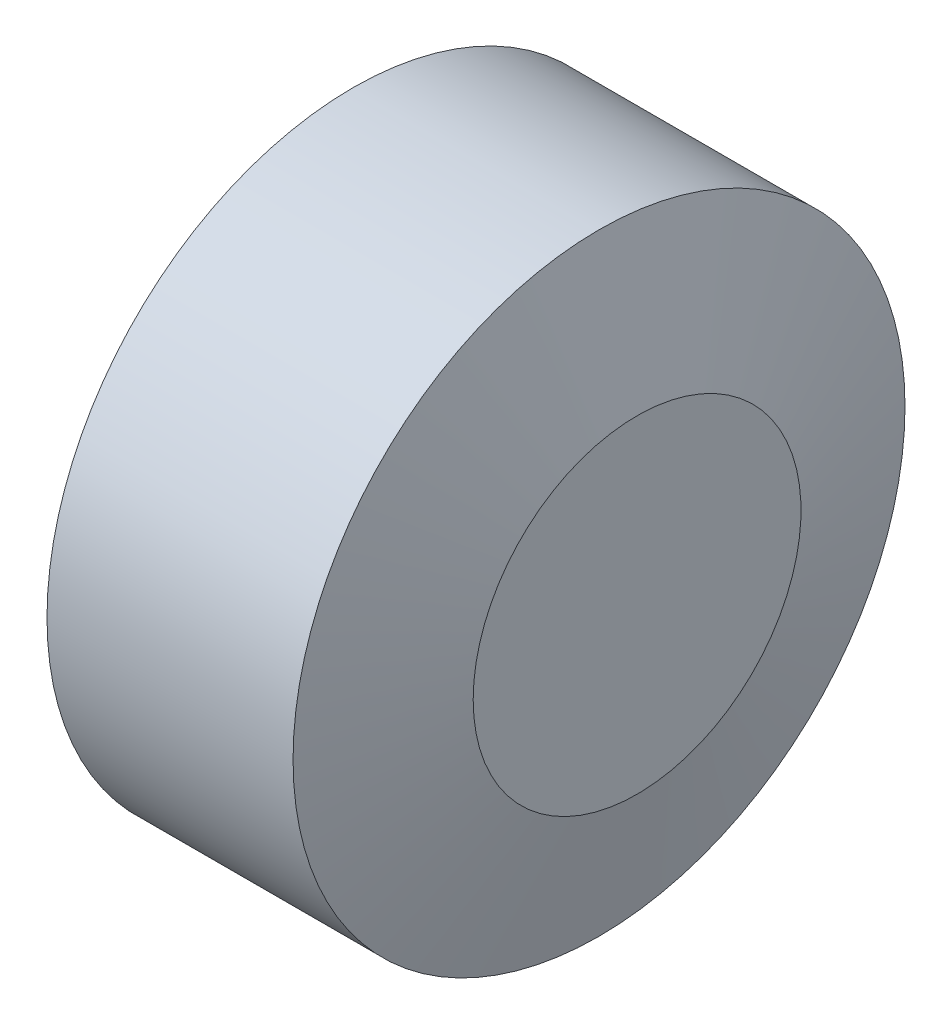
ISO-10303-21;
HEADER;
FILE_DESCRIPTION(('STEP AP214'),'2;1');
FILE_NAME('part.step','',(''),(''),'','','');
FILE_SCHEMA(('AUTOMOTIVE_DESIGN { 1 0 10303 214 1 1 1 1 }'));
ENDSEC;
DATA;
#1=APPLICATION_CONTEXT('core data for automotive mechanical design processes');
#2=APPLICATION_PROTOCOL_DEFINITION('international standard','automotive_design',2000,#1);
#3=PRODUCT_CONTEXT('',#1,'mechanical');
#4=PRODUCT('Part','Part','',(#3));
#5=PRODUCT_RELATED_PRODUCT_CATEGORY('part','',(#4));
#6=PRODUCT_DEFINITION_FORMATION('','',#4);
#7=PRODUCT_DEFINITION_CONTEXT('part definition',#1,'design');
#8=PRODUCT_DEFINITION('design','',#6,#7);
#9=PRODUCT_DEFINITION_SHAPE('','',#8);
#10=(LENGTH_UNIT() NAMED_UNIT(*) SI_UNIT(.MILLI.,.METRE.));
#11=(NAMED_UNIT(*) PLANE_ANGLE_UNIT() SI_UNIT($,.RADIAN.));
#12=(NAMED_UNIT(*) SI_UNIT($,.STERADIAN.) SOLID_ANGLE_UNIT());
#13=UNCERTAINTY_MEASURE_WITH_UNIT(LENGTH_MEASURE(1.E-05),#10,'distance_accuracy_value','');
#14=(GEOMETRIC_REPRESENTATION_CONTEXT(3) GLOBAL_UNCERTAINTY_ASSIGNED_CONTEXT((#13)) GLOBAL_UNIT_ASSIGNED_CONTEXT((#10,
#11,#12)) REPRESENTATION_CONTEXT('',''));
#15=CARTESIAN_POINT('',(0.,0.,0.));
#16=DIRECTION('',(0.,0.,1.));
#17=DIRECTION('',(1.,0.,0.));
#18=AXIS2_PLACEMENT_3D('',#15,#16,#17);
#19=CARTESIAN_POINT('',(0.,0.,0.));
#20=DIRECTION('',(-1.,0.,0.));
#21=DIRECTION('',(0.,0.,1.));
#22=AXIS2_PLACEMENT_3D('',#19,#20,#21);
#23=PLANE('',#22);
#24=CARTESIAN_POINT('',(0.,0.,0.));
#25=DIRECTION('',(-1.,0.,0.));
#26=DIRECTION('',(0.,0.,1.));
#27=AXIS2_PLACEMENT_3D('',#24,#25,#26);
#28=CIRCLE('',#27,14.);
#29=CARTESIAN_POINT('',(0.,0.,14.));
#30=VERTEX_POINT('',#29);
#31=EDGE_CURVE('E44',#30,#30,#28,.T.);
#32=ORIENTED_EDGE('',*,*,#31,.T.);
#33=EDGE_LOOP('',(#32));
#34=FACE_BOUND('',#33,.T.);
#35=ADVANCED_FACE('F347',(#34),#23,.T.);
#36=CARTESIAN_POINT('',(0.,0.,0.));
#37=DIRECTION('',(-1.,0.,0.));
#38=DIRECTION('',(0.,0.,1.));
#39=AXIS2_PLACEMENT_3D('',#36,#37,#38);
#40=CYLINDRICAL_SURFACE('',#39,14.);
#41=CARTESIAN_POINT('',(11.2583302491977,0.,0.));
#42=DIRECTION('',(-1.,0.,0.));
#43=DIRECTION('',(0.,0.,1.));
#44=AXIS2_PLACEMENT_3D('',#41,#42,#43);
#45=CIRCLE('',#44,14.);
#46=CARTESIAN_POINT('',(11.2583302491977,0.,14.));
#47=VERTEX_POINT('',#46);
#48=EDGE_CURVE('E353',#47,#47,#45,.T.);
#49=ORIENTED_EDGE('',*,*,#48,.T.);
#50=EDGE_LOOP('',(#49));
#51=FACE_BOUND('',#50,.T.);
#52=ORIENTED_EDGE('',*,*,#31,.F.);
#53=EDGE_LOOP('',(#52));
#54=FACE_BOUND('',#53,.T.);
#55=ADVANCED_FACE('F373',(#51,#54),#40,.T.);
#56=CARTESIAN_POINT('',(11.2583302491977,0.,0.));
#57=DIRECTION('',(-1.,0.,0.));
#58=DIRECTION('',(0.,0.,1.));
#59=AXIS2_PLACEMENT_3D('',#56,#57,#58);
#60=CONICAL_SURFACE('',#59,14.,1.30899693899575);
#61=CARTESIAN_POINT('',(13.,0.,0.));
#62=DIRECTION('',(-1.,0.,0.));
#63=DIRECTION('',(0.,0.,1.));
#64=AXIS2_PLACEMENT_3D('',#61,#62,#63);
#65=CIRCLE('',#64,7.5);
#66=CARTESIAN_POINT('',(13.,0.,7.5));
#67=VERTEX_POINT('',#66);
#68=EDGE_CURVE('E357',#67,#67,#65,.T.);
#69=ORIENTED_EDGE('',*,*,#68,.T.);
#70=EDGE_LOOP('',(#69));
#71=FACE_BOUND('',#70,.T.);
#72=ORIENTED_EDGE('',*,*,#48,.F.);
#73=EDGE_LOOP('',(#72));
#74=FACE_BOUND('',#73,.T.);
#75=ADVANCED_FACE('F364',(#71,#74),#60,.T.);
#76=CARTESIAN_POINT('',(13.,-7.5,0.));
#77=DIRECTION('',(1.,0.,0.));
#78=DIRECTION('',(0.,0.,-1.));
#79=AXIS2_PLACEMENT_3D('',#76,#77,#78);
#80=PLANE('',#79);
#81=ORIENTED_EDGE('',*,*,#68,.F.);
#82=EDGE_LOOP('',(#81));
#83=FACE_BOUND('',#82,.T.);
#84=ADVANCED_FACE('F367',(#83),#80,.T.);
#85=CLOSED_SHELL('',(#35,#55,#75,#84));
#86=MANIFOLD_SOLID_BREP('B6',#85);
#87=ADVANCED_BREP_SHAPE_REPRESENTATION('',(#18,#86),#14);
#88=SHAPE_DEFINITION_REPRESENTATION(#9,#87);
ENDSEC;
END-ISO-10303-21;
